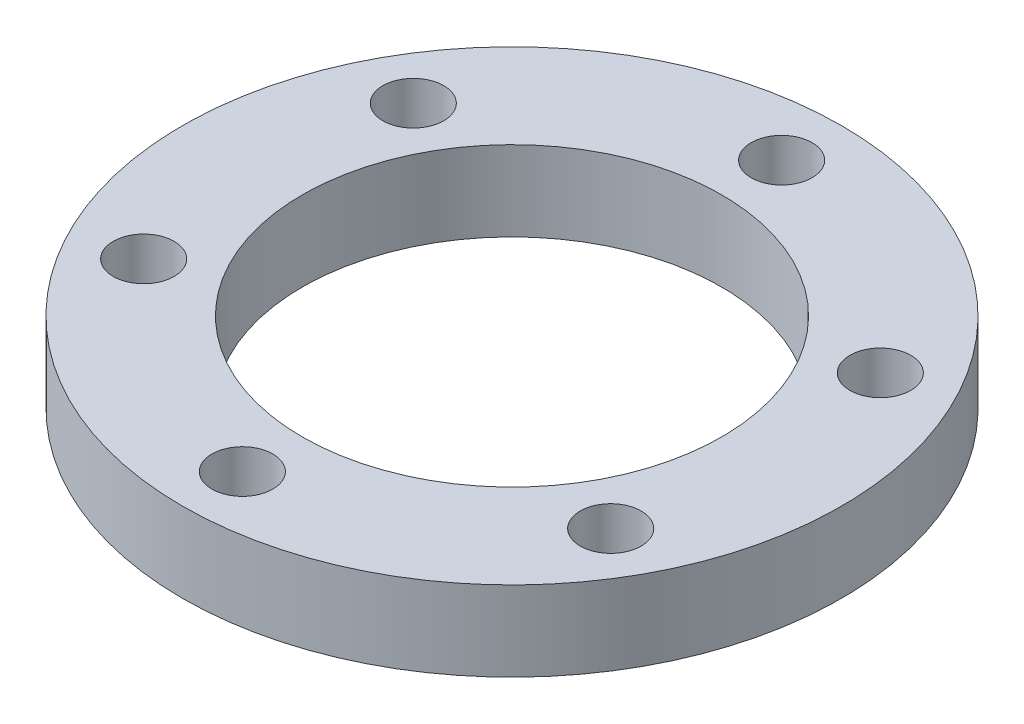
ISO-10303-21;
HEADER;
FILE_DESCRIPTION(('STEP AP214'),'2;1');
FILE_NAME('part.step','',(''),(''),'','','');
FILE_SCHEMA(('AUTOMOTIVE_DESIGN { 1 0 10303 214 1 1 1 1 }'));
ENDSEC;
DATA;
#1=APPLICATION_CONTEXT('core data for automotive mechanical design processes');
#2=APPLICATION_PROTOCOL_DEFINITION('international standard','automotive_design',2000,#1);
#3=PRODUCT_CONTEXT('',#1,'mechanical');
#4=PRODUCT('Part','Part','',(#3));
#5=PRODUCT_RELATED_PRODUCT_CATEGORY('part','',(#4));
#6=PRODUCT_DEFINITION_FORMATION('','',#4);
#7=PRODUCT_DEFINITION_CONTEXT('part definition',#1,'design');
#8=PRODUCT_DEFINITION('design','',#6,#7);
#9=PRODUCT_DEFINITION_SHAPE('','',#8);
#10=(LENGTH_UNIT() NAMED_UNIT(*) SI_UNIT(.MILLI.,.METRE.));
#11=(NAMED_UNIT(*) PLANE_ANGLE_UNIT() SI_UNIT($,.RADIAN.));
#12=(NAMED_UNIT(*) SI_UNIT($,.STERADIAN.) SOLID_ANGLE_UNIT());
#13=UNCERTAINTY_MEASURE_WITH_UNIT(LENGTH_MEASURE(1.E-05),#10,'distance_accuracy_value','');
#14=(GEOMETRIC_REPRESENTATION_CONTEXT(3) GLOBAL_UNCERTAINTY_ASSIGNED_CONTEXT((#13)) GLOBAL_UNIT_ASSIGNED_CONTEXT((#10,
#11,#12)) REPRESENTATION_CONTEXT('',''));
#15=CARTESIAN_POINT('',(0.,0.,0.));
#16=DIRECTION('',(0.,0.,1.));
#17=DIRECTION('',(1.,0.,0.));
#18=AXIS2_PLACEMENT_3D('',#15,#16,#17);
#19=CARTESIAN_POINT('',(0.,4.,0.));
#20=DIRECTION('',(0.,1.,0.));
#21=DIRECTION('',(0.,0.,1.));
#22=AXIS2_PLACEMENT_3D('',#19,#20,#21);
#23=PLANE('',#22);
#24=CARTESIAN_POINT('',(-11.6913429510899,4.,6.75000000000001));
#25=DIRECTION('',(0.,1.,0.));
#26=DIRECTION('',(0.,0.,1.));
#27=AXIS2_PLACEMENT_3D('',#24,#25,#26);
#28=CIRCLE('',#27,1.525);
#29=CARTESIAN_POINT('',(-11.6913429510899,4.,8.27500000000001));
#30=VERTEX_POINT('',#29);
#31=EDGE_CURVE('E72',#30,#30,#28,.T.);
#32=ORIENTED_EDGE('',*,*,#31,.F.);
#33=EDGE_LOOP('',(#32));
#34=FACE_BOUND('',#33,.T.);
#35=CARTESIAN_POINT('',(11.6913429510899,4.,6.75));
#36=DIRECTION('',(0.,1.,0.));
#37=DIRECTION('',(0.,0.,1.));
#38=AXIS2_PLACEMENT_3D('',#35,#36,#37);
#39=CIRCLE('',#38,1.52500000000001);
#40=CARTESIAN_POINT('',(11.6913429510899,4.,8.275));
#41=VERTEX_POINT('',#40);
#42=EDGE_CURVE('E60',#41,#41,#39,.T.);
#43=ORIENTED_EDGE('',*,*,#42,.F.);
#44=EDGE_LOOP('',(#43));
#45=FACE_BOUND('',#44,.T.);
#46=CARTESIAN_POINT('',(0.,4.,0.));
#47=DIRECTION('',(0.,1.,0.));
#48=DIRECTION('',(0.,0.,1.));
#49=AXIS2_PLACEMENT_3D('',#46,#47,#48);
#50=CIRCLE('',#49,10.5);
#51=CARTESIAN_POINT('',(0.,4.,10.5));
#52=VERTEX_POINT('',#51);
#53=EDGE_CURVE('E48',#52,#52,#50,.T.);
#54=ORIENTED_EDGE('',*,*,#53,.F.);
#55=EDGE_LOOP('',(#54));
#56=FACE_BOUND('',#55,.T.);
#57=CARTESIAN_POINT('',(0.,4.,0.));
#58=DIRECTION('',(0.,1.,0.));
#59=DIRECTION('',(0.,0.,1.));
#60=AXIS2_PLACEMENT_3D('',#57,#58,#59);
#61=CIRCLE('',#60,16.5);
#62=CARTESIAN_POINT('',(0.,4.,16.5));
#63=VERTEX_POINT('',#62);
#64=EDGE_CURVE('E10',#63,#63,#61,.T.);
#65=ORIENTED_EDGE('',*,*,#64,.T.);
#66=EDGE_LOOP('',(#65));
#67=FACE_BOUND('',#66,.T.);
#68=CARTESIAN_POINT('',(0.,4.,-13.5));
#69=DIRECTION('',(0.,1.,0.));
#70=DIRECTION('',(0.,0.,1.));
#71=AXIS2_PLACEMENT_3D('',#68,#69,#70);
#72=CIRCLE('',#71,1.525);
#73=CARTESIAN_POINT('',(0.,4.,-11.975));
#74=VERTEX_POINT('',#73);
#75=EDGE_CURVE('E43',#74,#74,#72,.T.);
#76=ORIENTED_EDGE('',*,*,#75,.F.);
#77=EDGE_LOOP('',(#76));
#78=FACE_BOUND('',#77,.T.);
#79=CARTESIAN_POINT('',(11.6913429510899,4.,-6.75));
#80=DIRECTION('',(0.,1.,0.));
#81=DIRECTION('',(0.,0.,1.));
#82=AXIS2_PLACEMENT_3D('',#79,#80,#81);
#83=CIRCLE('',#82,1.52500000000001);
#84=CARTESIAN_POINT('',(11.6913429510899,4.,-5.225));
#85=VERTEX_POINT('',#84);
#86=EDGE_CURVE('E54',#85,#85,#83,.T.);
#87=ORIENTED_EDGE('',*,*,#86,.F.);
#88=EDGE_LOOP('',(#87));
#89=FACE_BOUND('',#88,.T.);
#90=CARTESIAN_POINT('',(0.,4.,13.5));
#91=DIRECTION('',(0.,1.,0.));
#92=DIRECTION('',(0.,0.,1.));
#93=AXIS2_PLACEMENT_3D('',#90,#91,#92);
#94=CIRCLE('',#93,1.525);
#95=CARTESIAN_POINT('',(0.,4.,15.025));
#96=VERTEX_POINT('',#95);
#97=EDGE_CURVE('E66',#96,#96,#94,.T.);
#98=ORIENTED_EDGE('',*,*,#97,.F.);
#99=EDGE_LOOP('',(#98));
#100=FACE_BOUND('',#99,.T.);
#101=CARTESIAN_POINT('',(-11.6913429510899,4.,-6.74999999999999));
#102=DIRECTION('',(0.,1.,0.));
#103=DIRECTION('',(0.,0.,1.));
#104=AXIS2_PLACEMENT_3D('',#101,#102,#103);
#105=CIRCLE('',#104,1.525);
#106=CARTESIAN_POINT('',(-11.6913429510899,4.,-5.22499999999999));
#107=VERTEX_POINT('',#106);
#108=EDGE_CURVE('E78',#107,#107,#105,.T.);
#109=ORIENTED_EDGE('',*,*,#108,.F.);
#110=EDGE_LOOP('',(#109));
#111=FACE_BOUND('',#110,.T.);
#112=ADVANCED_FACE('F32',(#34,#45,#56,#67,#78,#89,#100,#111),#23,.T.);
#113=CARTESIAN_POINT('',(0.,0.,0.));
#114=DIRECTION('',(0.,1.,0.));
#115=DIRECTION('',(0.,0.,1.));
#116=AXIS2_PLACEMENT_3D('',#113,#114,#115);
#117=PLANE('',#116);
#118=CARTESIAN_POINT('',(0.,0.,0.));
#119=DIRECTION('',(0.,1.,0.));
#120=DIRECTION('',(0.,0.,1.));
#121=AXIS2_PLACEMENT_3D('',#118,#119,#120);
#122=CIRCLE('',#121,16.5);
#123=CARTESIAN_POINT('',(0.,0.,16.5));
#124=VERTEX_POINT('',#123);
#125=EDGE_CURVE('E36',#124,#124,#122,.T.);
#126=ORIENTED_EDGE('',*,*,#125,.F.);
#127=EDGE_LOOP('',(#126));
#128=FACE_BOUND('',#127,.T.);
#129=CARTESIAN_POINT('',(0.,0.,-13.5));
#130=DIRECTION('',(0.,1.,0.));
#131=DIRECTION('',(0.,0.,1.));
#132=AXIS2_PLACEMENT_3D('',#129,#130,#131);
#133=CIRCLE('',#132,1.525);
#134=CARTESIAN_POINT('',(0.,0.,-11.975));
#135=VERTEX_POINT('',#134);
#136=EDGE_CURVE('E45',#135,#135,#133,.T.);
#137=ORIENTED_EDGE('',*,*,#136,.T.);
#138=EDGE_LOOP('',(#137));
#139=FACE_BOUND('',#138,.T.);
#140=CARTESIAN_POINT('',(0.,0.,0.));
#141=DIRECTION('',(0.,1.,0.));
#142=DIRECTION('',(0.,0.,1.));
#143=AXIS2_PLACEMENT_3D('',#140,#141,#142);
#144=CIRCLE('',#143,10.5);
#145=CARTESIAN_POINT('',(0.,0.,10.5));
#146=VERTEX_POINT('',#145);
#147=EDGE_CURVE('E51',#146,#146,#144,.T.);
#148=ORIENTED_EDGE('',*,*,#147,.T.);
#149=EDGE_LOOP('',(#148));
#150=FACE_BOUND('',#149,.T.);
#151=CARTESIAN_POINT('',(11.6913429510899,0.,-6.75));
#152=DIRECTION('',(0.,1.,0.));
#153=DIRECTION('',(0.,0.,1.));
#154=AXIS2_PLACEMENT_3D('',#151,#152,#153);
#155=CIRCLE('',#154,1.52500000000001);
#156=CARTESIAN_POINT('',(11.6913429510899,0.,-5.225));
#157=VERTEX_POINT('',#156);
#158=EDGE_CURVE('E57',#157,#157,#155,.T.);
#159=ORIENTED_EDGE('',*,*,#158,.T.);
#160=EDGE_LOOP('',(#159));
#161=FACE_BOUND('',#160,.T.);
#162=CARTESIAN_POINT('',(11.6913429510899,0.,6.75));
#163=DIRECTION('',(0.,1.,0.));
#164=DIRECTION('',(0.,0.,1.));
#165=AXIS2_PLACEMENT_3D('',#162,#163,#164);
#166=CIRCLE('',#165,1.52500000000001);
#167=CARTESIAN_POINT('',(11.6913429510899,0.,8.275));
#168=VERTEX_POINT('',#167);
#169=EDGE_CURVE('E63',#168,#168,#166,.T.);
#170=ORIENTED_EDGE('',*,*,#169,.T.);
#171=EDGE_LOOP('',(#170));
#172=FACE_BOUND('',#171,.T.);
#173=CARTESIAN_POINT('',(0.,0.,13.5));
#174=DIRECTION('',(0.,1.,0.));
#175=DIRECTION('',(0.,0.,1.));
#176=AXIS2_PLACEMENT_3D('',#173,#174,#175);
#177=CIRCLE('',#176,1.525);
#178=CARTESIAN_POINT('',(0.,0.,15.025));
#179=VERTEX_POINT('',#178);
#180=EDGE_CURVE('E69',#179,#179,#177,.T.);
#181=ORIENTED_EDGE('',*,*,#180,.T.);
#182=EDGE_LOOP('',(#181));
#183=FACE_BOUND('',#182,.T.);
#184=CARTESIAN_POINT('',(-11.6913429510899,0.,6.75000000000001));
#185=DIRECTION('',(0.,1.,0.));
#186=DIRECTION('',(0.,0.,1.));
#187=AXIS2_PLACEMENT_3D('',#184,#185,#186);
#188=CIRCLE('',#187,1.525);
#189=CARTESIAN_POINT('',(-11.6913429510899,0.,8.27500000000001));
#190=VERTEX_POINT('',#189);
#191=EDGE_CURVE('E75',#190,#190,#188,.T.);
#192=ORIENTED_EDGE('',*,*,#191,.T.);
#193=EDGE_LOOP('',(#192));
#194=FACE_BOUND('',#193,.T.);
#195=CARTESIAN_POINT('',(-11.6913429510899,0.,-6.74999999999999));
#196=DIRECTION('',(0.,1.,0.));
#197=DIRECTION('',(0.,0.,1.));
#198=AXIS2_PLACEMENT_3D('',#195,#196,#197);
#199=CIRCLE('',#198,1.525);
#200=CARTESIAN_POINT('',(-11.6913429510899,0.,-5.22499999999999));
#201=VERTEX_POINT('',#200);
#202=EDGE_CURVE('E81',#201,#201,#199,.T.);
#203=ORIENTED_EDGE('',*,*,#202,.T.);
#204=EDGE_LOOP('',(#203));
#205=FACE_BOUND('',#204,.T.);
#206=ADVANCED_FACE('F91',(#128,#139,#150,#161,#172,#183,#194,#205),#117,.F.);
#207=CARTESIAN_POINT('',(0.,4.,0.));
#208=DIRECTION('',(0.,-1.,0.));
#209=DIRECTION('',(0.,0.,-1.));
#210=AXIS2_PLACEMENT_3D('',#207,#208,#209);
#211=CYLINDRICAL_SURFACE('',#210,16.5);
#212=ORIENTED_EDGE('',*,*,#64,.F.);
#213=EDGE_LOOP('',(#212));
#214=FACE_BOUND('',#213,.T.);
#215=ORIENTED_EDGE('',*,*,#125,.T.);
#216=EDGE_LOOP('',(#215));
#217=FACE_BOUND('',#216,.T.);
#218=ADVANCED_FACE('F34',(#214,#217),#211,.T.);
#219=CARTESIAN_POINT('',(0.,4.,-13.5));
#220=DIRECTION('',(0.,-1.,0.));
#221=DIRECTION('',(0.,0.,-1.));
#222=AXIS2_PLACEMENT_3D('',#219,#220,#221);
#223=CYLINDRICAL_SURFACE('',#222,1.525);
#224=ORIENTED_EDGE('',*,*,#75,.T.);
#225=EDGE_LOOP('',(#224));
#226=FACE_BOUND('',#225,.T.);
#227=ORIENTED_EDGE('',*,*,#136,.F.);
#228=EDGE_LOOP('',(#227));
#229=FACE_BOUND('',#228,.T.);
#230=ADVANCED_FACE('F101',(#226,#229),#223,.F.);
#231=CARTESIAN_POINT('',(0.,4.,0.));
#232=DIRECTION('',(0.,-1.,0.));
#233=DIRECTION('',(0.,0.,-1.));
#234=AXIS2_PLACEMENT_3D('',#231,#232,#233);
#235=CYLINDRICAL_SURFACE('',#234,10.5);
#236=ORIENTED_EDGE('',*,*,#53,.T.);
#237=EDGE_LOOP('',(#236));
#238=FACE_BOUND('',#237,.T.);
#239=ORIENTED_EDGE('',*,*,#147,.F.);
#240=EDGE_LOOP('',(#239));
#241=FACE_BOUND('',#240,.T.);
#242=ADVANCED_FACE('F104',(#238,#241),#235,.F.);
#243=CARTESIAN_POINT('',(11.6913429510899,4.,-6.75));
#244=DIRECTION('',(0.,-1.,0.));
#245=DIRECTION('',(0.,0.,-1.));
#246=AXIS2_PLACEMENT_3D('',#243,#244,#245);
#247=CYLINDRICAL_SURFACE('',#246,1.52500000000001);
#248=ORIENTED_EDGE('',*,*,#86,.T.);
#249=EDGE_LOOP('',(#248));
#250=FACE_BOUND('',#249,.T.);
#251=ORIENTED_EDGE('',*,*,#158,.F.);
#252=EDGE_LOOP('',(#251));
#253=FACE_BOUND('',#252,.T.);
#254=ADVANCED_FACE('F108',(#250,#253),#247,.F.);
#255=CARTESIAN_POINT('',(11.6913429510899,4.,6.75));
#256=DIRECTION('',(0.,-1.,0.));
#257=DIRECTION('',(0.,0.,-1.));
#258=AXIS2_PLACEMENT_3D('',#255,#256,#257);
#259=CYLINDRICAL_SURFACE('',#258,1.52500000000001);
#260=ORIENTED_EDGE('',*,*,#42,.T.);
#261=EDGE_LOOP('',(#260));
#262=FACE_BOUND('',#261,.T.);
#263=ORIENTED_EDGE('',*,*,#169,.F.);
#264=EDGE_LOOP('',(#263));
#265=FACE_BOUND('',#264,.T.);
#266=ADVANCED_FACE('F112',(#262,#265),#259,.F.);
#267=CARTESIAN_POINT('',(0.,4.,13.5));
#268=DIRECTION('',(0.,-1.,0.));
#269=DIRECTION('',(0.,0.,-1.));
#270=AXIS2_PLACEMENT_3D('',#267,#268,#269);
#271=CYLINDRICAL_SURFACE('',#270,1.525);
#272=ORIENTED_EDGE('',*,*,#97,.T.);
#273=EDGE_LOOP('',(#272));
#274=FACE_BOUND('',#273,.T.);
#275=ORIENTED_EDGE('',*,*,#180,.F.);
#276=EDGE_LOOP('',(#275));
#277=FACE_BOUND('',#276,.T.);
#278=ADVANCED_FACE('F116',(#274,#277),#271,.F.);
#279=CARTESIAN_POINT('',(-11.6913429510899,4.,6.75000000000001));
#280=DIRECTION('',(0.,-1.,0.));
#281=DIRECTION('',(0.,0.,-1.));
#282=AXIS2_PLACEMENT_3D('',#279,#280,#281);
#283=CYLINDRICAL_SURFACE('',#282,1.525);
#284=ORIENTED_EDGE('',*,*,#31,.T.);
#285=EDGE_LOOP('',(#284));
#286=FACE_BOUND('',#285,.T.);
#287=ORIENTED_EDGE('',*,*,#191,.F.);
#288=EDGE_LOOP('',(#287));
#289=FACE_BOUND('',#288,.T.);
#290=ADVANCED_FACE('F120',(#286,#289),#283,.F.);
#291=CARTESIAN_POINT('',(-11.6913429510899,4.,-6.74999999999999));
#292=DIRECTION('',(0.,-1.,0.));
#293=DIRECTION('',(0.,0.,-1.));
#294=AXIS2_PLACEMENT_3D('',#291,#292,#293);
#295=CYLINDRICAL_SURFACE('',#294,1.525);
#296=ORIENTED_EDGE('',*,*,#108,.T.);
#297=EDGE_LOOP('',(#296));
#298=FACE_BOUND('',#297,.T.);
#299=ORIENTED_EDGE('',*,*,#202,.F.);
#300=EDGE_LOOP('',(#299));
#301=FACE_BOUND('',#300,.T.);
#302=ADVANCED_FACE('F87',(#298,#301),#295,.F.);
#303=CLOSED_SHELL('',(#112,#206,#218,#230,#242,#254,#266,#278,#290,#302));
#304=MANIFOLD_SOLID_BREP('B2',#303);
#305=ADVANCED_BREP_SHAPE_REPRESENTATION('',(#18,#304),#14);
#306=SHAPE_DEFINITION_REPRESENTATION(#9,#305);
ENDSEC;
END-ISO-10303-21;
